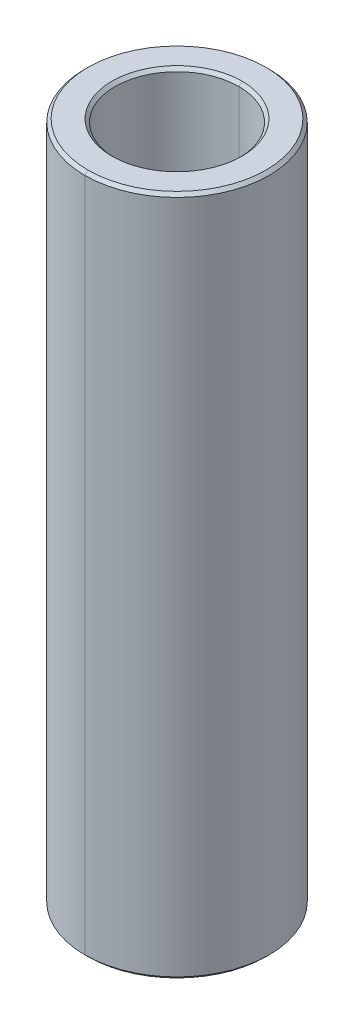
ISO-10303-21;
HEADER;
FILE_DESCRIPTION(('STEP AP214'),'2;1');
FILE_NAME('part.step','',(''),(''),'','','');
FILE_SCHEMA(('AUTOMOTIVE_DESIGN { 1 0 10303 214 1 1 1 1 }'));
ENDSEC;
DATA;
#1=APPLICATION_CONTEXT('core data for automotive mechanical design processes');
#2=APPLICATION_PROTOCOL_DEFINITION('international standard','automotive_design',2000,#1);
#3=PRODUCT_CONTEXT('',#1,'mechanical');
#4=PRODUCT('Part','Part','',(#3));
#5=PRODUCT_RELATED_PRODUCT_CATEGORY('part','',(#4));
#6=PRODUCT_DEFINITION_FORMATION('','',#4);
#7=PRODUCT_DEFINITION_CONTEXT('part definition',#1,'design');
#8=PRODUCT_DEFINITION('design','',#6,#7);
#9=PRODUCT_DEFINITION_SHAPE('','',#8);
#10=(LENGTH_UNIT() NAMED_UNIT(*) SI_UNIT(.MILLI.,.METRE.));
#11=(NAMED_UNIT(*) PLANE_ANGLE_UNIT() SI_UNIT($,.RADIAN.));
#12=(NAMED_UNIT(*) SI_UNIT($,.STERADIAN.) SOLID_ANGLE_UNIT());
#13=UNCERTAINTY_MEASURE_WITH_UNIT(LENGTH_MEASURE(1.E-05),#10,'distance_accuracy_value','');
#14=(GEOMETRIC_REPRESENTATION_CONTEXT(3) GLOBAL_UNCERTAINTY_ASSIGNED_CONTEXT((#13)) GLOBAL_UNIT_ASSIGNED_CONTEXT((#10,
#11,#12)) REPRESENTATION_CONTEXT('',''));
#15=CARTESIAN_POINT('',(0.,0.,0.));
#16=DIRECTION('',(0.,0.,1.));
#17=DIRECTION('',(1.,0.,0.));
#18=AXIS2_PLACEMENT_3D('',#15,#16,#17);
#19=CARTESIAN_POINT('',(0.,10.9,0.));
#20=DIRECTION('',(0.,1.,0.));
#21=DIRECTION('',(0.,0.,1.));
#22=AXIS2_PLACEMENT_3D('',#19,#20,#21);
#23=CONICAL_SURFACE('',#22,2.,0.785398163397448);
#24=DIRECTION('',(0.,0.707106781186548,-0.707106781186548));
#25=VECTOR('',#24,1.);
#26=CARTESIAN_POINT('',(0.,10.9,-2.));
#27=LINE('',#26,#25);
#28=CARTESIAN_POINT('',(0.,10.9,-2.));
#29=VERTEX_POINT('',#28);
#30=CARTESIAN_POINT('',(0.,11.,-2.1));
#31=VERTEX_POINT('',#30);
#32=EDGE_CURVE('E153',#29,#31,#27,.T.);
#33=ORIENTED_EDGE('',*,*,#32,.F.);
#34=CARTESIAN_POINT('',(0.,10.9,0.));
#35=DIRECTION('',(0.,1.,0.));
#36=DIRECTION('',(0.,0.,1.));
#37=AXIS2_PLACEMENT_3D('',#34,#35,#36);
#38=CIRCLE('',#37,2.);
#39=CARTESIAN_POINT('',(0.,10.9,2.));
#40=VERTEX_POINT('',#39);
#41=EDGE_CURVE('E25',#40,#29,#38,.T.);
#42=ORIENTED_EDGE('',*,*,#41,.F.);
#43=DIRECTION('',(0.,0.707106781186548,0.707106781186548));
#44=VECTOR('',#43,1.);
#45=CARTESIAN_POINT('',(0.,10.9,2.));
#46=LINE('',#45,#44);
#47=CARTESIAN_POINT('',(0.,11.,2.1));
#48=VERTEX_POINT('',#47);
#49=EDGE_CURVE('E191',#40,#48,#46,.T.);
#50=ORIENTED_EDGE('',*,*,#49,.T.);
#51=CARTESIAN_POINT('',(0.,11.,0.));
#52=DIRECTION('',(0.,-1.,0.));
#53=DIRECTION('',(0.,0.,1.));
#54=AXIS2_PLACEMENT_3D('',#51,#52,#53);
#55=CIRCLE('',#54,2.1);
#56=EDGE_CURVE('E164',#31,#48,#55,.T.);
#57=ORIENTED_EDGE('',*,*,#56,.F.);
#58=EDGE_LOOP('',(#33,#42,#50,#57));
#59=FACE_BOUND('',#58,.T.);
#60=ADVANCED_FACE('F14',(#59),#23,.F.);
#61=CARTESIAN_POINT('',(0.,-11.,0.));
#62=DIRECTION('',(0.,-1.,0.));
#63=DIRECTION('',(0.,0.,-1.));
#64=AXIS2_PLACEMENT_3D('',#61,#62,#63);
#65=CONICAL_SURFACE('',#64,2.1,0.785398163397448);
#66=DIRECTION('',(0.,-0.707106781186548,0.707106781186548));
#67=VECTOR('',#66,1.);
#68=CARTESIAN_POINT('',(0.,-11.,2.1));
#69=LINE('',#68,#67);
#70=CARTESIAN_POINT('',(0.,-10.9,2.));
#71=VERTEX_POINT('',#70);
#72=CARTESIAN_POINT('',(0.,-11.,2.1));
#73=VERTEX_POINT('',#72);
#74=EDGE_CURVE('E122',#71,#73,#69,.T.);
#75=ORIENTED_EDGE('',*,*,#74,.F.);
#76=CARTESIAN_POINT('',(0.,-10.9,0.));
#77=DIRECTION('',(0.,-1.,0.));
#78=DIRECTION('',(0.,0.,1.));
#79=AXIS2_PLACEMENT_3D('',#76,#77,#78);
#80=CIRCLE('',#79,2.);
#81=CARTESIAN_POINT('',(0.,-10.9,-2.));
#82=VERTEX_POINT('',#81);
#83=EDGE_CURVE('E9',#82,#71,#80,.T.);
#84=ORIENTED_EDGE('',*,*,#83,.F.);
#85=DIRECTION('',(0.,-0.707106781186548,-0.707106781186548));
#86=VECTOR('',#85,1.);
#87=CARTESIAN_POINT('',(0.,-11.,-2.1));
#88=LINE('',#87,#86);
#89=CARTESIAN_POINT('',(0.,-11.,-2.1));
#90=VERTEX_POINT('',#89);
#91=EDGE_CURVE('E112',#82,#90,#88,.T.);
#92=ORIENTED_EDGE('',*,*,#91,.T.);
#93=CARTESIAN_POINT('',(0.,-11.,0.));
#94=DIRECTION('',(0.,1.,0.));
#95=DIRECTION('',(0.,0.,1.));
#96=AXIS2_PLACEMENT_3D('',#93,#94,#95);
#97=CIRCLE('',#96,2.1);
#98=EDGE_CURVE('E99',#73,#90,#97,.T.);
#99=ORIENTED_EDGE('',*,*,#98,.F.);
#100=EDGE_LOOP('',(#75,#84,#92,#99));
#101=FACE_BOUND('',#100,.T.);
#102=ADVANCED_FACE('F113',(#101),#65,.F.);
#103=CARTESIAN_POINT('',(0.,11.,0.));
#104=DIRECTION('',(0.,-1.,0.));
#105=DIRECTION('',(0.,0.,-1.));
#106=AXIS2_PLACEMENT_3D('',#103,#104,#105);
#107=CONICAL_SURFACE('',#106,2.875,0.785398163397457);
#108=DIRECTION('',(0.,-0.707106781186542,0.707106781186554));
#109=VECTOR('',#108,1.);
#110=CARTESIAN_POINT('',(0.,11.,2.875));
#111=LINE('',#110,#109);
#112=CARTESIAN_POINT('',(0.,11.,2.875));
#113=VERTEX_POINT('',#112);
#114=CARTESIAN_POINT('',(0.,10.9,2.975));
#115=VERTEX_POINT('',#114);
#116=EDGE_CURVE('E136',#113,#115,#111,.T.);
#117=ORIENTED_EDGE('',*,*,#116,.F.);
#118=CARTESIAN_POINT('',(0.,11.,0.));
#119=DIRECTION('',(0.,1.,0.));
#120=DIRECTION('',(0.,0.,1.));
#121=AXIS2_PLACEMENT_3D('',#118,#119,#120);
#122=CIRCLE('',#121,2.875);
#123=CARTESIAN_POINT('',(0.,11.,-2.875));
#124=VERTEX_POINT('',#123);
#125=EDGE_CURVE('E151',#124,#113,#122,.T.);
#126=ORIENTED_EDGE('',*,*,#125,.F.);
#127=DIRECTION('',(0.,-0.707106781186542,-0.707106781186554));
#128=VECTOR('',#127,1.);
#129=CARTESIAN_POINT('',(0.,11.,-2.875));
#130=LINE('',#129,#128);
#131=CARTESIAN_POINT('',(0.,10.9,-2.975));
#132=VERTEX_POINT('',#131);
#133=EDGE_CURVE('E170',#124,#132,#130,.T.);
#134=ORIENTED_EDGE('',*,*,#133,.T.);
#135=CARTESIAN_POINT('',(0.,10.9,0.));
#136=DIRECTION('',(0.,-1.,0.));
#137=DIRECTION('',(0.,0.,1.));
#138=AXIS2_PLACEMENT_3D('',#135,#136,#137);
#139=CIRCLE('',#138,2.975);
#140=EDGE_CURVE('E18',#115,#132,#139,.T.);
#141=ORIENTED_EDGE('',*,*,#140,.F.);
#142=EDGE_LOOP('',(#117,#126,#134,#141));
#143=FACE_BOUND('',#142,.T.);
#144=ADVANCED_FACE('F212',(#143),#107,.T.);
#145=CARTESIAN_POINT('',(0.,-10.9,0.));
#146=DIRECTION('',(0.,1.,0.));
#147=DIRECTION('',(0.,0.,1.));
#148=AXIS2_PLACEMENT_3D('',#145,#146,#147);
#149=CONICAL_SURFACE('',#148,2.975,0.785398163397466);
#150=DIRECTION('',(0.,0.707106781186535,-0.70710678118656));
#151=VECTOR('',#150,1.);
#152=CARTESIAN_POINT('',(0.,-10.9,-2.975));
#153=LINE('',#152,#151);
#154=CARTESIAN_POINT('',(0.,-11.,-2.875));
#155=VERTEX_POINT('',#154);
#156=CARTESIAN_POINT('',(0.,-10.9,-2.975));
#157=VERTEX_POINT('',#156);
#158=EDGE_CURVE('E142',#155,#157,#153,.T.);
#159=ORIENTED_EDGE('',*,*,#158,.F.);
#160=CARTESIAN_POINT('',(0.,-11.,0.));
#161=DIRECTION('',(0.,-1.,0.));
#162=DIRECTION('',(0.,0.,1.));
#163=AXIS2_PLACEMENT_3D('',#160,#161,#162);
#164=CIRCLE('',#163,2.875);
#165=CARTESIAN_POINT('',(0.,-11.,2.875));
#166=VERTEX_POINT('',#165);
#167=EDGE_CURVE('E109',#166,#155,#164,.T.);
#168=ORIENTED_EDGE('',*,*,#167,.F.);
#169=DIRECTION('',(0.,0.707106781186535,0.70710678118656));
#170=VECTOR('',#169,1.);
#171=CARTESIAN_POINT('',(0.,-10.9,2.975));
#172=LINE('',#171,#170);
#173=CARTESIAN_POINT('',(0.,-10.9,2.975));
#174=VERTEX_POINT('',#173);
#175=EDGE_CURVE('E141',#166,#174,#172,.T.);
#176=ORIENTED_EDGE('',*,*,#175,.T.);
#177=CARTESIAN_POINT('',(0.,-10.9,0.));
#178=DIRECTION('',(0.,1.,0.));
#179=DIRECTION('',(0.,0.,1.));
#180=AXIS2_PLACEMENT_3D('',#177,#178,#179);
#181=CIRCLE('',#180,2.975);
#182=EDGE_CURVE('E39',#157,#174,#181,.T.);
#183=ORIENTED_EDGE('',*,*,#182,.F.);
#184=EDGE_LOOP('',(#159,#168,#176,#183));
#185=FACE_BOUND('',#184,.T.);
#186=ADVANCED_FACE('F322',(#185),#149,.T.);
#187=CARTESIAN_POINT('',(0.,11.,0.));
#188=DIRECTION('',(0.,-1.,0.));
#189=DIRECTION('',(0.,0.,-1.));
#190=AXIS2_PLACEMENT_3D('',#187,#188,#189);
#191=CYLINDRICAL_SURFACE('',#190,2.);
#192=DIRECTION('',(0.,-1.,0.));
#193=VECTOR('',#192,1.);
#194=CARTESIAN_POINT('',(0.,11.,2.));
#195=LINE('',#194,#193);
#196=EDGE_CURVE('E143',#40,#71,#195,.T.);
#197=ORIENTED_EDGE('',*,*,#196,.F.);
#198=ORIENTED_EDGE('',*,*,#41,.T.);
#199=DIRECTION('',(0.,-1.,0.));
#200=VECTOR('',#199,1.);
#201=CARTESIAN_POINT('',(0.,11.,-2.));
#202=LINE('',#201,#200);
#203=EDGE_CURVE('E147',#29,#82,#202,.T.);
#204=ORIENTED_EDGE('',*,*,#203,.T.);
#205=ORIENTED_EDGE('',*,*,#83,.T.);
#206=EDGE_LOOP('',(#197,#198,#204,#205));
#207=FACE_BOUND('',#206,.T.);
#208=ADVANCED_FACE('F271',(#207),#191,.F.);
#209=CARTESIAN_POINT('',(0.,11.,0.));
#210=DIRECTION('',(0.,-1.,0.));
#211=DIRECTION('',(0.,0.,-1.));
#212=AXIS2_PLACEMENT_3D('',#209,#210,#211);
#213=CYLINDRICAL_SURFACE('',#212,2.975);
#214=DIRECTION('',(0.,-1.,0.));
#215=VECTOR('',#214,1.);
#216=CARTESIAN_POINT('',(0.,11.,2.975));
#217=LINE('',#216,#215);
#218=EDGE_CURVE('E152',#115,#174,#217,.T.);
#219=ORIENTED_EDGE('',*,*,#218,.F.);
#220=ORIENTED_EDGE('',*,*,#140,.T.);
#221=DIRECTION('',(0.,-1.,0.));
#222=VECTOR('',#221,1.);
#223=CARTESIAN_POINT('',(0.,11.,-2.975));
#224=LINE('',#223,#222);
#225=EDGE_CURVE('E148',#132,#157,#224,.T.);
#226=ORIENTED_EDGE('',*,*,#225,.T.);
#227=ORIENTED_EDGE('',*,*,#182,.T.);
#228=EDGE_LOOP('',(#219,#220,#226,#227));
#229=FACE_BOUND('',#228,.T.);
#230=ADVANCED_FACE('F220',(#229),#213,.T.);
#231=CARTESIAN_POINT('',(0.,-11.,0.));
#232=DIRECTION('',(0.,1.,0.));
#233=DIRECTION('',(1.,0.,0.));
#234=AXIS2_PLACEMENT_3D('',#231,#232,#233);
#235=PLANE('',#234);
#236=CARTESIAN_POINT('',(0.,-11.,0.));
#237=DIRECTION('',(0.,1.,0.));
#238=DIRECTION('',(0.,0.,1.));
#239=AXIS2_PLACEMENT_3D('',#236,#237,#238);
#240=CIRCLE('',#239,2.1);
#241=EDGE_CURVE('E104',#90,#73,#240,.T.);
#242=ORIENTED_EDGE('',*,*,#241,.T.);
#243=ORIENTED_EDGE('',*,*,#98,.T.);
#244=EDGE_LOOP('',(#242,#243));
#245=FACE_BOUND('',#244,.T.);
#246=ORIENTED_EDGE('',*,*,#167,.T.);
#247=CARTESIAN_POINT('',(0.,-11.,0.));
#248=DIRECTION('',(0.,-1.,0.));
#249=DIRECTION('',(0.,0.,1.));
#250=AXIS2_PLACEMENT_3D('',#247,#248,#249);
#251=CIRCLE('',#250,2.875);
#252=EDGE_CURVE('E162',#155,#166,#251,.T.);
#253=ORIENTED_EDGE('',*,*,#252,.T.);
#254=EDGE_LOOP('',(#246,#253));
#255=FACE_BOUND('',#254,.T.);
#256=ADVANCED_FACE('F101',(#245,#255),#235,.F.);
#257=CARTESIAN_POINT('',(0.,11.,0.));
#258=DIRECTION('',(0.,1.,0.));
#259=DIRECTION('',(1.,0.,0.));
#260=AXIS2_PLACEMENT_3D('',#257,#258,#259);
#261=PLANE('',#260);
#262=CARTESIAN_POINT('',(0.,11.,0.));
#263=DIRECTION('',(0.,-1.,0.));
#264=DIRECTION('',(0.,0.,1.));
#265=AXIS2_PLACEMENT_3D('',#262,#263,#264);
#266=CIRCLE('',#265,2.1);
#267=EDGE_CURVE('E157',#48,#31,#266,.T.);
#268=ORIENTED_EDGE('',*,*,#267,.T.);
#269=ORIENTED_EDGE('',*,*,#56,.T.);
#270=EDGE_LOOP('',(#268,#269));
#271=FACE_BOUND('',#270,.T.);
#272=ORIENTED_EDGE('',*,*,#125,.T.);
#273=CARTESIAN_POINT('',(0.,11.,0.));
#274=DIRECTION('',(0.,1.,0.));
#275=DIRECTION('',(0.,0.,1.));
#276=AXIS2_PLACEMENT_3D('',#273,#274,#275);
#277=CIRCLE('',#276,2.875);
#278=EDGE_CURVE('E119',#113,#124,#277,.T.);
#279=ORIENTED_EDGE('',*,*,#278,.T.);
#280=EDGE_LOOP('',(#272,#279));
#281=FACE_BOUND('',#280,.T.);
#282=ADVANCED_FACE('F208',(#271,#281),#261,.T.);
#283=CARTESIAN_POINT('',(0.,11.,0.));
#284=DIRECTION('',(0.,-1.,0.));
#285=DIRECTION('',(0.,0.,-1.));
#286=AXIS2_PLACEMENT_3D('',#283,#284,#285);
#287=CYLINDRICAL_SURFACE('',#286,2.975);
#288=CARTESIAN_POINT('',(0.,10.9,0.));
#289=DIRECTION('',(0.,-1.,0.));
#290=DIRECTION('',(0.,0.,1.));
#291=AXIS2_PLACEMENT_3D('',#288,#289,#290);
#292=CIRCLE('',#291,2.975);
#293=EDGE_CURVE('E166',#132,#115,#292,.T.);
#294=ORIENTED_EDGE('',*,*,#293,.T.);
#295=ORIENTED_EDGE('',*,*,#218,.T.);
#296=CARTESIAN_POINT('',(0.,-10.9,0.));
#297=DIRECTION('',(0.,1.,0.));
#298=DIRECTION('',(0.,0.,1.));
#299=AXIS2_PLACEMENT_3D('',#296,#297,#298);
#300=CIRCLE('',#299,2.975);
#301=EDGE_CURVE('E137',#174,#157,#300,.T.);
#302=ORIENTED_EDGE('',*,*,#301,.T.);
#303=ORIENTED_EDGE('',*,*,#225,.F.);
#304=EDGE_LOOP('',(#294,#295,#302,#303));
#305=FACE_BOUND('',#304,.T.);
#306=ADVANCED_FACE('F218',(#305),#287,.T.);
#307=CARTESIAN_POINT('',(0.,11.,0.));
#308=DIRECTION('',(0.,-1.,0.));
#309=DIRECTION('',(0.,0.,-1.));
#310=AXIS2_PLACEMENT_3D('',#307,#308,#309);
#311=CYLINDRICAL_SURFACE('',#310,2.);
#312=CARTESIAN_POINT('',(0.,10.9,0.));
#313=DIRECTION('',(0.,1.,0.));
#314=DIRECTION('',(0.,0.,1.));
#315=AXIS2_PLACEMENT_3D('',#312,#313,#314);
#316=CIRCLE('',#315,2.);
#317=EDGE_CURVE('E158',#29,#40,#316,.T.);
#318=ORIENTED_EDGE('',*,*,#317,.T.);
#319=ORIENTED_EDGE('',*,*,#196,.T.);
#320=CARTESIAN_POINT('',(0.,-10.9,0.));
#321=DIRECTION('',(0.,-1.,0.));
#322=DIRECTION('',(0.,0.,1.));
#323=AXIS2_PLACEMENT_3D('',#320,#321,#322);
#324=CIRCLE('',#323,2.);
#325=EDGE_CURVE('E130',#71,#82,#324,.T.);
#326=ORIENTED_EDGE('',*,*,#325,.T.);
#327=ORIENTED_EDGE('',*,*,#203,.F.);
#328=EDGE_LOOP('',(#318,#319,#326,#327));
#329=FACE_BOUND('',#328,.T.);
#330=ADVANCED_FACE('F254',(#329),#311,.F.);
#331=CARTESIAN_POINT('',(0.,-10.9,0.));
#332=DIRECTION('',(0.,1.,0.));
#333=DIRECTION('',(0.,0.,1.));
#334=AXIS2_PLACEMENT_3D('',#331,#332,#333);
#335=CONICAL_SURFACE('',#334,2.975,0.785398163397466);
#336=ORIENTED_EDGE('',*,*,#252,.F.);
#337=ORIENTED_EDGE('',*,*,#158,.T.);
#338=ORIENTED_EDGE('',*,*,#301,.F.);
#339=ORIENTED_EDGE('',*,*,#175,.F.);
#340=EDGE_LOOP('',(#336,#337,#338,#339));
#341=FACE_BOUND('',#340,.T.);
#342=ADVANCED_FACE('F16',(#341),#335,.T.);
#343=CARTESIAN_POINT('',(0.,11.,0.));
#344=DIRECTION('',(0.,-1.,0.));
#345=DIRECTION('',(0.,0.,-1.));
#346=AXIS2_PLACEMENT_3D('',#343,#344,#345);
#347=CONICAL_SURFACE('',#346,2.875,0.785398163397457);
#348=ORIENTED_EDGE('',*,*,#278,.F.);
#349=ORIENTED_EDGE('',*,*,#116,.T.);
#350=ORIENTED_EDGE('',*,*,#293,.F.);
#351=ORIENTED_EDGE('',*,*,#133,.F.);
#352=EDGE_LOOP('',(#348,#349,#350,#351));
#353=FACE_BOUND('',#352,.T.);
#354=ADVANCED_FACE('F215',(#353),#347,.T.);
#355=CARTESIAN_POINT('',(0.,-11.,0.));
#356=DIRECTION('',(0.,-1.,0.));
#357=DIRECTION('',(0.,0.,-1.));
#358=AXIS2_PLACEMENT_3D('',#355,#356,#357);
#359=CONICAL_SURFACE('',#358,2.1,0.785398163397448);
#360=ORIENTED_EDGE('',*,*,#325,.F.);
#361=ORIENTED_EDGE('',*,*,#74,.T.);
#362=ORIENTED_EDGE('',*,*,#241,.F.);
#363=ORIENTED_EDGE('',*,*,#91,.F.);
#364=EDGE_LOOP('',(#360,#361,#362,#363));
#365=FACE_BOUND('',#364,.T.);
#366=ADVANCED_FACE('F121',(#365),#359,.F.);
#367=CARTESIAN_POINT('',(0.,10.9,0.));
#368=DIRECTION('',(0.,1.,0.));
#369=DIRECTION('',(0.,0.,1.));
#370=AXIS2_PLACEMENT_3D('',#367,#368,#369);
#371=CONICAL_SURFACE('',#370,2.,0.785398163397448);
#372=ORIENTED_EDGE('',*,*,#317,.F.);
#373=ORIENTED_EDGE('',*,*,#32,.T.);
#374=ORIENTED_EDGE('',*,*,#267,.F.);
#375=ORIENTED_EDGE('',*,*,#49,.F.);
#376=EDGE_LOOP('',(#372,#373,#374,#375));
#377=FACE_BOUND('',#376,.T.);
#378=ADVANCED_FACE('F330',(#377),#371,.F.);
#379=CLOSED_SHELL('',(#60,#102,#144,#186,#208,#230,#256,#282,#306,#330,#342,#354,#366,#378));
#380=MANIFOLD_SOLID_BREP('B1',#379);
#381=ADVANCED_BREP_SHAPE_REPRESENTATION('',(#18,#380),#14);
#382=SHAPE_DEFINITION_REPRESENTATION(#9,#381);
ENDSEC;
END-ISO-10303-21;
